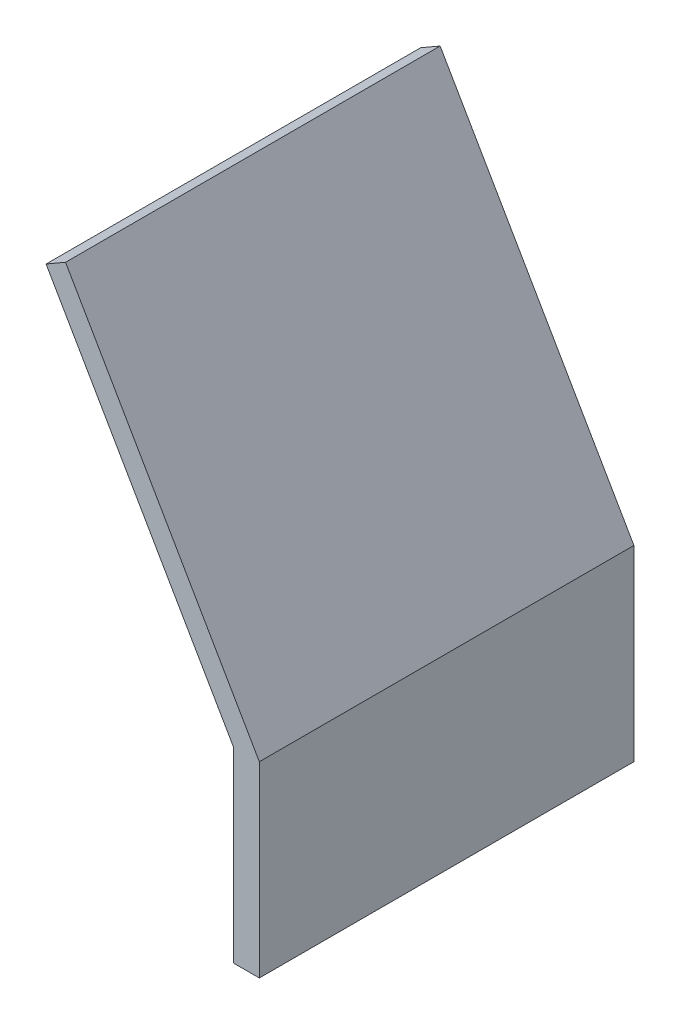
ISO-10303-21;
HEADER;
FILE_DESCRIPTION(('STEP AP214'),'2;1');
FILE_NAME('part.step','',(''),(''),'','','');
FILE_SCHEMA(('AUTOMOTIVE_DESIGN { 1 0 10303 214 1 1 1 1 }'));
ENDSEC;
DATA;
#1=APPLICATION_CONTEXT('core data for automotive mechanical design processes');
#2=APPLICATION_PROTOCOL_DEFINITION('international standard','automotive_design',2000,#1);
#3=PRODUCT_CONTEXT('',#1,'mechanical');
#4=PRODUCT('Part','Part','',(#3));
#5=PRODUCT_RELATED_PRODUCT_CATEGORY('part','',(#4));
#6=PRODUCT_DEFINITION_FORMATION('','',#4);
#7=PRODUCT_DEFINITION_CONTEXT('part definition',#1,'design');
#8=PRODUCT_DEFINITION('design','',#6,#7);
#9=PRODUCT_DEFINITION_SHAPE('','',#8);
#10=(LENGTH_UNIT() NAMED_UNIT(*) SI_UNIT(.MILLI.,.METRE.));
#11=(NAMED_UNIT(*) PLANE_ANGLE_UNIT() SI_UNIT($,.RADIAN.));
#12=(NAMED_UNIT(*) SI_UNIT($,.STERADIAN.) SOLID_ANGLE_UNIT());
#13=UNCERTAINTY_MEASURE_WITH_UNIT(LENGTH_MEASURE(1.E-05),#10,'distance_accuracy_value','');
#14=(GEOMETRIC_REPRESENTATION_CONTEXT(3) GLOBAL_UNCERTAINTY_ASSIGNED_CONTEXT((#13)) GLOBAL_UNIT_ASSIGNED_CONTEXT((#10,
#11,#12)) REPRESENTATION_CONTEXT('',''));
#15=CARTESIAN_POINT('',(0.,0.,0.));
#16=DIRECTION('',(0.,0.,1.));
#17=DIRECTION('',(1.,0.,0.));
#18=AXIS2_PLACEMENT_3D('',#15,#16,#17);
#19=CARTESIAN_POINT('',(-25.8660254037845,44.8012701892219,25.));
#20=DIRECTION('',(0.500000000000002,-0.866025403784437,0.));
#21=DIRECTION('',(0.866025403784437,0.500000000000002,0.));
#22=AXIS2_PLACEMENT_3D('',#19,#20,#21);
#23=PLANE('',#22);
#24=DIRECTION('',(-0.866025403784437,-0.500000000000002,0.));
#25=VECTOR('',#24,1.);
#26=CARTESIAN_POINT('',(-25.8660254037845,44.8012701892219,-25.));
#27=LINE('',#26,#25);
#28=CARTESIAN_POINT('',(-25.8660254037845,44.8012701892219,-25.));
#29=VERTEX_POINT('',#28);
#30=CARTESIAN_POINT('',(-28.4641016151378,43.3012701892219,-25.));
#31=VERTEX_POINT('',#30);
#32=EDGE_CURVE('E128',#29,#31,#27,.T.);
#33=ORIENTED_EDGE('',*,*,#32,.T.);
#34=DIRECTION('',(0.,0.,-1.));
#35=VECTOR('',#34,1.);
#36=CARTESIAN_POINT('',(-28.4641016151378,43.3012701892219,25.));
#37=LINE('',#36,#35);
#38=CARTESIAN_POINT('',(-28.4641016151378,43.3012701892219,25.));
#39=VERTEX_POINT('',#38);
#40=EDGE_CURVE('E11',#39,#31,#37,.T.);
#41=ORIENTED_EDGE('',*,*,#40,.F.);
#42=DIRECTION('',(-0.866025403784437,-0.500000000000002,0.));
#43=VECTOR('',#42,1.);
#44=CARTESIAN_POINT('',(-25.8660254037845,44.8012701892219,25.));
#45=LINE('',#44,#43);
#46=CARTESIAN_POINT('',(-25.8660254037845,44.8012701892219,25.));
#47=VERTEX_POINT('',#46);
#48=EDGE_CURVE('E144',#47,#39,#45,.T.);
#49=ORIENTED_EDGE('',*,*,#48,.F.);
#50=DIRECTION('',(0.,0.,-1.));
#51=VECTOR('',#50,1.);
#52=CARTESIAN_POINT('',(-25.8660254037845,44.8012701892219,25.));
#53=LINE('',#52,#51);
#54=EDGE_CURVE('E124',#47,#29,#53,.T.);
#55=ORIENTED_EDGE('',*,*,#54,.T.);
#56=EDGE_LOOP('',(#33,#41,#49,#55));
#57=FACE_BOUND('',#56,.T.);
#58=ADVANCED_FACE('F39',(#57),#23,.F.);
#59=CARTESIAN_POINT('',(-28.4641016151378,43.3012701892219,25.));
#60=DIRECTION('',(0.866025403784438,0.500000000000001,0.));
#61=DIRECTION('',(-0.500000000000001,0.866025403784438,0.));
#62=AXIS2_PLACEMENT_3D('',#59,#60,#61);
#63=PLANE('',#62);
#64=DIRECTION('',(0.500000000000001,-0.866025403784438,0.));
#65=VECTOR('',#64,1.);
#66=CARTESIAN_POINT('',(-28.4641016151378,43.3012701892219,-25.));
#67=LINE('',#66,#65);
#68=CARTESIAN_POINT('',(-3.46410161513775,0.,-25.));
#69=VERTEX_POINT('',#68);
#70=EDGE_CURVE('E132',#31,#69,#67,.T.);
#71=ORIENTED_EDGE('',*,*,#70,.T.);
#72=DIRECTION('',(0.,0.,-1.));
#73=VECTOR('',#72,1.);
#74=CARTESIAN_POINT('',(-3.46410161513775,0.,25.));
#75=LINE('',#74,#73);
#76=CARTESIAN_POINT('',(-3.46410161513775,0.,25.));
#77=VERTEX_POINT('',#76);
#78=EDGE_CURVE('E48',#77,#69,#75,.T.);
#79=ORIENTED_EDGE('',*,*,#78,.F.);
#80=DIRECTION('',(0.500000000000001,-0.866025403784438,0.));
#81=VECTOR('',#80,1.);
#82=CARTESIAN_POINT('',(-28.4641016151378,43.3012701892219,25.));
#83=LINE('',#82,#81);
#84=EDGE_CURVE('E93',#39,#77,#83,.T.);
#85=ORIENTED_EDGE('',*,*,#84,.F.);
#86=ORIENTED_EDGE('',*,*,#40,.T.);
#87=EDGE_LOOP('',(#71,#79,#85,#86));
#88=FACE_BOUND('',#87,.T.);
#89=ADVANCED_FACE('F172',(#88),#63,.F.);
#90=CARTESIAN_POINT('',(-3.46410161513775,0.,25.));
#91=DIRECTION('',(1.,0.,0.));
#92=DIRECTION('',(0.,1.,0.));
#93=AXIS2_PLACEMENT_3D('',#90,#91,#92);
#94=PLANE('',#93);
#95=DIRECTION('',(0.,-1.,0.));
#96=VECTOR('',#95,1.);
#97=CARTESIAN_POINT('',(-3.46410161513775,0.,-25.));
#98=LINE('',#97,#96);
#99=CARTESIAN_POINT('',(-3.46410161513774,-25.,-25.));
#100=VERTEX_POINT('',#99);
#101=EDGE_CURVE('E135',#69,#100,#98,.T.);
#102=ORIENTED_EDGE('',*,*,#101,.T.);
#103=DIRECTION('',(0.,0.,-1.));
#104=VECTOR('',#103,1.);
#105=CARTESIAN_POINT('',(-3.46410161513774,-25.,25.));
#106=LINE('',#105,#104);
#107=CARTESIAN_POINT('',(-3.46410161513774,-25.,25.));
#108=VERTEX_POINT('',#107);
#109=EDGE_CURVE('E117',#108,#100,#106,.T.);
#110=ORIENTED_EDGE('',*,*,#109,.F.);
#111=DIRECTION('',(0.,-1.,0.));
#112=VECTOR('',#111,1.);
#113=CARTESIAN_POINT('',(-3.46410161513775,0.,25.));
#114=LINE('',#113,#112);
#115=EDGE_CURVE('E106',#77,#108,#114,.T.);
#116=ORIENTED_EDGE('',*,*,#115,.F.);
#117=ORIENTED_EDGE('',*,*,#78,.T.);
#118=EDGE_LOOP('',(#102,#110,#116,#117));
#119=FACE_BOUND('',#118,.T.);
#120=ADVANCED_FACE('F154',(#119),#94,.F.);
#121=CARTESIAN_POINT('',(0.,-25.,25.));
#122=DIRECTION('',(0.,1.,0.));
#123=DIRECTION('',(0.,0.,1.));
#124=AXIS2_PLACEMENT_3D('',#121,#122,#123);
#125=PLANE('',#124);
#126=DIRECTION('',(1.,0.,0.));
#127=VECTOR('',#126,1.);
#128=CARTESIAN_POINT('',(0.,-25.,-25.));
#129=LINE('',#128,#127);
#130=CARTESIAN_POINT('',(0.,-25.,-25.));
#131=VERTEX_POINT('',#130);
#132=EDGE_CURVE('E115',#100,#131,#129,.T.);
#133=ORIENTED_EDGE('',*,*,#132,.T.);
#134=DIRECTION('',(0.,0.,-1.));
#135=VECTOR('',#134,1.);
#136=CARTESIAN_POINT('',(0.,-25.,25.));
#137=LINE('',#136,#135);
#138=CARTESIAN_POINT('',(0.,-25.,25.));
#139=VERTEX_POINT('',#138);
#140=EDGE_CURVE('E112',#139,#131,#137,.T.);
#141=ORIENTED_EDGE('',*,*,#140,.F.);
#142=DIRECTION('',(1.,0.,0.));
#143=VECTOR('',#142,1.);
#144=CARTESIAN_POINT('',(0.,-25.,25.));
#145=LINE('',#144,#143);
#146=EDGE_CURVE('E100',#108,#139,#145,.T.);
#147=ORIENTED_EDGE('',*,*,#146,.F.);
#148=ORIENTED_EDGE('',*,*,#109,.T.);
#149=EDGE_LOOP('',(#133,#141,#147,#148));
#150=FACE_BOUND('',#149,.T.);
#151=ADVANCED_FACE('F113',(#150),#125,.F.);
#152=CARTESIAN_POINT('',(0.,0.,25.));
#153=DIRECTION('',(-1.,0.,0.));
#154=DIRECTION('',(0.,-1.,0.));
#155=AXIS2_PLACEMENT_3D('',#152,#153,#154);
#156=PLANE('',#155);
#157=DIRECTION('',(0.,1.,0.));
#158=VECTOR('',#157,1.);
#159=CARTESIAN_POINT('',(0.,0.,-25.));
#160=LINE('',#159,#158);
#161=CARTESIAN_POINT('',(0.,0.,-25.));
#162=VERTEX_POINT('',#161);
#163=EDGE_CURVE('E79',#131,#162,#160,.T.);
#164=ORIENTED_EDGE('',*,*,#163,.T.);
#165=DIRECTION('',(0.,0.,-1.));
#166=VECTOR('',#165,1.);
#167=CARTESIAN_POINT('',(0.,0.,25.));
#168=LINE('',#167,#166);
#169=CARTESIAN_POINT('',(0.,0.,25.));
#170=VERTEX_POINT('',#169);
#171=EDGE_CURVE('E118',#170,#162,#168,.T.);
#172=ORIENTED_EDGE('',*,*,#171,.F.);
#173=DIRECTION('',(0.,1.,0.));
#174=VECTOR('',#173,1.);
#175=CARTESIAN_POINT('',(0.,0.,25.));
#176=LINE('',#175,#174);
#177=EDGE_CURVE('E104',#139,#170,#176,.T.);
#178=ORIENTED_EDGE('',*,*,#177,.F.);
#179=ORIENTED_EDGE('',*,*,#140,.T.);
#180=EDGE_LOOP('',(#164,#172,#178,#179));
#181=FACE_BOUND('',#180,.T.);
#182=ADVANCED_FACE('F120',(#181),#156,.F.);
#183=CARTESIAN_POINT('',(0.,0.,25.));
#184=DIRECTION('',(-0.866025403784438,-0.500000000000001,0.));
#185=DIRECTION('',(0.500000000000001,-0.866025403784438,0.));
#186=AXIS2_PLACEMENT_3D('',#183,#184,#185);
#187=PLANE('',#186);
#188=DIRECTION('',(-0.500000000000001,0.866025403784438,0.));
#189=VECTOR('',#188,1.);
#190=CARTESIAN_POINT('',(0.,0.,-25.));
#191=LINE('',#190,#189);
#192=EDGE_CURVE('E85',#162,#29,#191,.T.);
#193=ORIENTED_EDGE('',*,*,#192,.T.);
#194=ORIENTED_EDGE('',*,*,#54,.F.);
#195=DIRECTION('',(-0.500000000000001,0.866025403784438,0.));
#196=VECTOR('',#195,1.);
#197=CARTESIAN_POINT('',(0.,0.,25.));
#198=LINE('',#197,#196);
#199=EDGE_CURVE('E56',#170,#47,#198,.T.);
#200=ORIENTED_EDGE('',*,*,#199,.F.);
#201=ORIENTED_EDGE('',*,*,#171,.T.);
#202=EDGE_LOOP('',(#193,#194,#200,#201));
#203=FACE_BOUND('',#202,.T.);
#204=ADVANCED_FACE('F161',(#203),#187,.F.);
#205=CARTESIAN_POINT('',(0.,0.,25.));
#206=DIRECTION('',(0.,0.,1.));
#207=DIRECTION('',(1.,0.,0.));
#208=AXIS2_PLACEMENT_3D('',#205,#206,#207);
#209=PLANE('',#208);
#210=ORIENTED_EDGE('',*,*,#48,.T.);
#211=ORIENTED_EDGE('',*,*,#84,.T.);
#212=ORIENTED_EDGE('',*,*,#115,.T.);
#213=ORIENTED_EDGE('',*,*,#146,.T.);
#214=ORIENTED_EDGE('',*,*,#177,.T.);
#215=ORIENTED_EDGE('',*,*,#199,.T.);
#216=EDGE_LOOP('',(#210,#211,#212,#213,#214,#215));
#217=FACE_BOUND('',#216,.T.);
#218=ADVANCED_FACE('F102',(#217),#209,.T.);
#219=CARTESIAN_POINT('',(0.,0.,-25.));
#220=DIRECTION('',(0.,0.,1.));
#221=DIRECTION('',(1.,0.,0.));
#222=AXIS2_PLACEMENT_3D('',#219,#220,#221);
#223=PLANE('',#222);
#224=ORIENTED_EDGE('',*,*,#32,.F.);
#225=ORIENTED_EDGE('',*,*,#192,.F.);
#226=ORIENTED_EDGE('',*,*,#163,.F.);
#227=ORIENTED_EDGE('',*,*,#132,.F.);
#228=ORIENTED_EDGE('',*,*,#101,.F.);
#229=ORIENTED_EDGE('',*,*,#70,.F.);
#230=EDGE_LOOP('',(#224,#225,#226,#227,#228,#229));
#231=FACE_BOUND('',#230,.T.);
#232=ADVANCED_FACE('F157',(#231),#223,.F.);
#233=CLOSED_SHELL('',(#58,#89,#120,#151,#182,#204,#218,#232));
#234=MANIFOLD_SOLID_BREP('B2',#233);
#235=ADVANCED_BREP_SHAPE_REPRESENTATION('',(#18,#234),#14);
#236=SHAPE_DEFINITION_REPRESENTATION(#9,#235);
ENDSEC;
END-ISO-10303-21;
